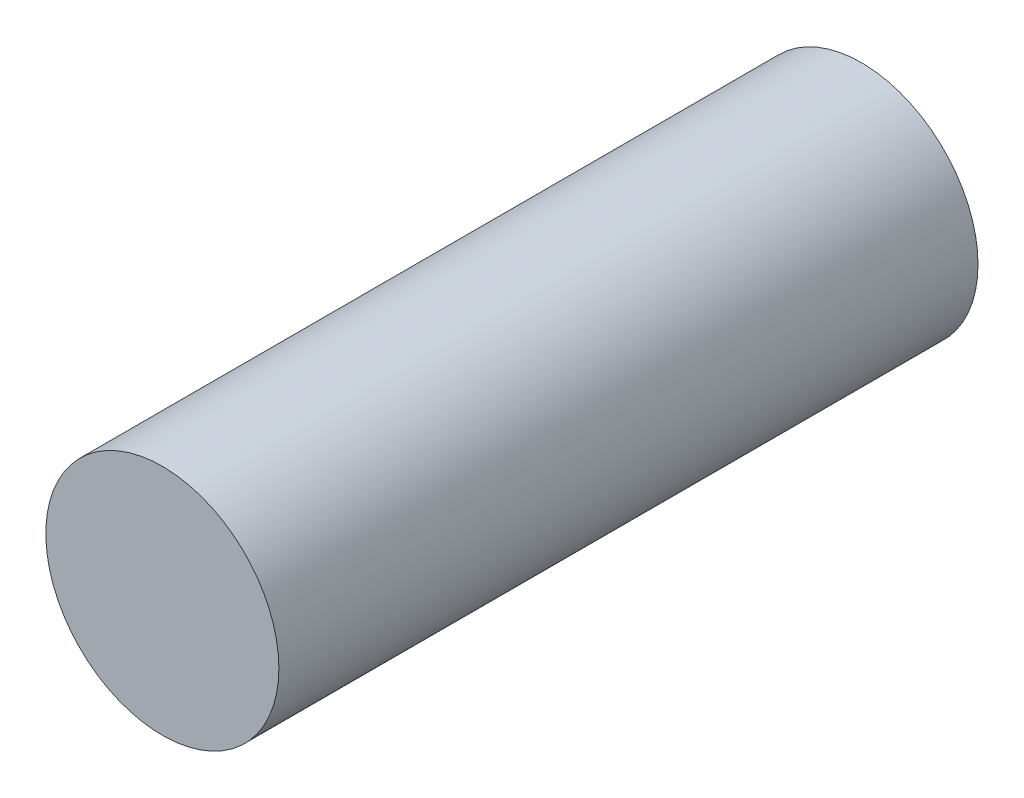
ISO-10303-21;
HEADER;
FILE_DESCRIPTION(('STEP AP214'),'2;1');
FILE_NAME('part.step','',(''),(''),'','','');
FILE_SCHEMA(('AUTOMOTIVE_DESIGN { 1 0 10303 214 1 1 1 1 }'));
ENDSEC;
DATA;
#1=APPLICATION_CONTEXT('core data for automotive mechanical design processes');
#2=APPLICATION_PROTOCOL_DEFINITION('international standard','automotive_design',2000,#1);
#3=PRODUCT_CONTEXT('',#1,'mechanical');
#4=PRODUCT('Part','Part','',(#3));
#5=PRODUCT_RELATED_PRODUCT_CATEGORY('part','',(#4));
#6=PRODUCT_DEFINITION_FORMATION('','',#4);
#7=PRODUCT_DEFINITION_CONTEXT('part definition',#1,'design');
#8=PRODUCT_DEFINITION('design','',#6,#7);
#9=PRODUCT_DEFINITION_SHAPE('','',#8);
#10=(LENGTH_UNIT() NAMED_UNIT(*) SI_UNIT(.MILLI.,.METRE.));
#11=(NAMED_UNIT(*) PLANE_ANGLE_UNIT() SI_UNIT($,.RADIAN.));
#12=(NAMED_UNIT(*) SI_UNIT($,.STERADIAN.) SOLID_ANGLE_UNIT());
#13=UNCERTAINTY_MEASURE_WITH_UNIT(LENGTH_MEASURE(1.E-05),#10,'distance_accuracy_value','');
#14=(GEOMETRIC_REPRESENTATION_CONTEXT(3) GLOBAL_UNCERTAINTY_ASSIGNED_CONTEXT((#13)) GLOBAL_UNIT_ASSIGNED_CONTEXT((#10,
#11,#12)) REPRESENTATION_CONTEXT('',''));
#15=CARTESIAN_POINT('',(0.,0.,0.));
#16=DIRECTION('',(0.,0.,1.));
#17=DIRECTION('',(1.,0.,0.));
#18=AXIS2_PLACEMENT_3D('',#15,#16,#17);
#19=CARTESIAN_POINT('',(0.,0.,30.));
#20=DIRECTION('',(0.,0.,-1.));
#21=DIRECTION('',(-1.,0.,0.));
#22=AXIS2_PLACEMENT_3D('',#19,#20,#21);
#23=CYLINDRICAL_SURFACE('',#22,5.);
#24=CARTESIAN_POINT('',(0.,0.,30.));
#25=DIRECTION('',(0.,0.,1.));
#26=DIRECTION('',(1.,0.,0.));
#27=AXIS2_PLACEMENT_3D('',#24,#25,#26);
#28=CIRCLE('',#27,5.);
#29=CARTESIAN_POINT('',(5.,0.,30.));
#30=VERTEX_POINT('',#29);
#31=EDGE_CURVE('E10',#30,#30,#28,.T.);
#32=ORIENTED_EDGE('',*,*,#31,.F.);
#33=EDGE_LOOP('',(#32));
#34=FACE_BOUND('',#33,.T.);
#35=CARTESIAN_POINT('',(0.,0.,0.));
#36=DIRECTION('',(0.,0.,1.));
#37=DIRECTION('',(1.,0.,0.));
#38=AXIS2_PLACEMENT_3D('',#35,#36,#37);
#39=CIRCLE('',#38,5.);
#40=CARTESIAN_POINT('',(5.,0.,0.));
#41=VERTEX_POINT('',#40);
#42=EDGE_CURVE('E34',#41,#41,#39,.T.);
#43=ORIENTED_EDGE('',*,*,#42,.T.);
#44=EDGE_LOOP('',(#43));
#45=FACE_BOUND('',#44,.T.);
#46=ADVANCED_FACE('F31',(#34,#45),#23,.T.);
#47=CARTESIAN_POINT('',(0.,0.,30.));
#48=DIRECTION('',(0.,0.,1.));
#49=DIRECTION('',(1.,0.,0.));
#50=AXIS2_PLACEMENT_3D('',#47,#48,#49);
#51=PLANE('',#50);
#52=ORIENTED_EDGE('',*,*,#31,.T.);
#53=EDGE_LOOP('',(#52));
#54=FACE_BOUND('',#53,.T.);
#55=ADVANCED_FACE('F46',(#54),#51,.T.);
#56=CARTESIAN_POINT('',(0.,0.,0.));
#57=DIRECTION('',(0.,0.,1.));
#58=DIRECTION('',(1.,0.,0.));
#59=AXIS2_PLACEMENT_3D('',#56,#57,#58);
#60=PLANE('',#59);
#61=ORIENTED_EDGE('',*,*,#42,.F.);
#62=EDGE_LOOP('',(#61));
#63=FACE_BOUND('',#62,.T.);
#64=ADVANCED_FACE('F44',(#63),#60,.F.);
#65=CLOSED_SHELL('',(#46,#55,#64));
#66=MANIFOLD_SOLID_BREP('B2',#65);
#67=ADVANCED_BREP_SHAPE_REPRESENTATION('',(#18,#66),#14);
#68=SHAPE_DEFINITION_REPRESENTATION(#9,#67);
ENDSEC;
END-ISO-10303-21;
